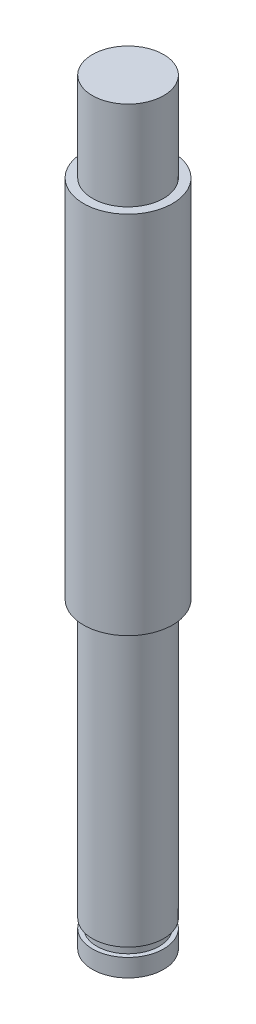
ISO-10303-21;
HEADER;
FILE_DESCRIPTION(('STEP AP214'),'2;1');
FILE_NAME('part.step','',(''),(''),'','','');
FILE_SCHEMA(('AUTOMOTIVE_DESIGN { 1 0 10303 214 1 1 1 1 }'));
ENDSEC;
DATA;
#1=APPLICATION_CONTEXT('core data for automotive mechanical design processes');
#2=APPLICATION_PROTOCOL_DEFINITION('international standard','automotive_design',2000,#1);
#3=PRODUCT_CONTEXT('',#1,'mechanical');
#4=PRODUCT('Part','Part','',(#3));
#5=PRODUCT_RELATED_PRODUCT_CATEGORY('part','',(#4));
#6=PRODUCT_DEFINITION_FORMATION('','',#4);
#7=PRODUCT_DEFINITION_CONTEXT('part definition',#1,'design');
#8=PRODUCT_DEFINITION('design','',#6,#7);
#9=PRODUCT_DEFINITION_SHAPE('','',#8);
#10=(LENGTH_UNIT() NAMED_UNIT(*) SI_UNIT(.MILLI.,.METRE.));
#11=(NAMED_UNIT(*) PLANE_ANGLE_UNIT() SI_UNIT($,.RADIAN.));
#12=(NAMED_UNIT(*) SI_UNIT($,.STERADIAN.) SOLID_ANGLE_UNIT());
#13=UNCERTAINTY_MEASURE_WITH_UNIT(LENGTH_MEASURE(1.E-05),#10,'distance_accuracy_value','');
#14=(GEOMETRIC_REPRESENTATION_CONTEXT(3) GLOBAL_UNCERTAINTY_ASSIGNED_CONTEXT((#13)) GLOBAL_UNIT_ASSIGNED_CONTEXT((#10,
#11,#12)) REPRESENTATION_CONTEXT('',''));
#15=CARTESIAN_POINT('',(0.,0.,0.));
#16=DIRECTION('',(0.,0.,1.));
#17=DIRECTION('',(1.,0.,0.));
#18=AXIS2_PLACEMENT_3D('',#15,#16,#17);
#19=CARTESIAN_POINT('',(0.,-34.,0.));
#20=DIRECTION('',(0.,-1.,0.));
#21=DIRECTION('',(0.,0.,-1.));
#22=AXIS2_PLACEMENT_3D('',#19,#20,#21);
#23=PLANE('',#22);
#24=CARTESIAN_POINT('',(0.,-34.,0.));
#25=DIRECTION('',(0.,-1.,0.));
#26=DIRECTION('',(0.,0.,-1.));
#27=AXIS2_PLACEMENT_3D('',#24,#25,#26);
#28=CIRCLE('',#27,4.);
#29=CARTESIAN_POINT('',(0.,-34.,-4.));
#30=VERTEX_POINT('',#29);
#31=EDGE_CURVE('E18',#30,#30,#28,.F.);
#32=ORIENTED_EDGE('',*,*,#31,.F.);
#33=EDGE_LOOP('',(#32));
#34=FACE_BOUND('',#33,.T.);
#35=ADVANCED_FACE('F15',(#34),#23,.T.);
#36=CARTESIAN_POINT('',(0.,0.,0.));
#37=DIRECTION('',(0.,-1.,0.));
#38=DIRECTION('',(0.,0.,-1.));
#39=AXIS2_PLACEMENT_3D('',#36,#37,#38);
#40=CYLINDRICAL_SURFACE('',#39,4.);
#41=ORIENTED_EDGE('',*,*,#31,.T.);
#42=EDGE_LOOP('',(#41));
#43=FACE_BOUND('',#42,.T.);
#44=CARTESIAN_POINT('',(0.,-32.,0.));
#45=DIRECTION('',(0.,-1.,0.));
#46=DIRECTION('',(0.,0.,-1.));
#47=AXIS2_PLACEMENT_3D('',#44,#45,#46);
#48=CIRCLE('',#47,4.);
#49=CARTESIAN_POINT('',(0.,-32.,-4.));
#50=VERTEX_POINT('',#49);
#51=EDGE_CURVE('E46',#50,#50,#48,.T.);
#52=ORIENTED_EDGE('',*,*,#51,.T.);
#53=EDGE_LOOP('',(#52));
#54=FACE_BOUND('',#53,.T.);
#55=ADVANCED_FACE('F53',(#43,#54),#40,.T.);
#56=CARTESIAN_POINT('',(0.,-32.,0.));
#57=DIRECTION('',(0.,-1.,0.));
#58=DIRECTION('',(0.,0.,-1.));
#59=AXIS2_PLACEMENT_3D('',#56,#57,#58);
#60=PLANE('',#59);
#61=CARTESIAN_POINT('',(0.,-32.,0.));
#62=DIRECTION('',(0.,-1.,0.));
#63=DIRECTION('',(0.,0.,-1.));
#64=AXIS2_PLACEMENT_3D('',#61,#62,#63);
#65=CIRCLE('',#64,3.5);
#66=CARTESIAN_POINT('',(0.,-32.,-3.5));
#67=VERTEX_POINT('',#66);
#68=EDGE_CURVE('E44',#67,#67,#65,.F.);
#69=ORIENTED_EDGE('',*,*,#68,.F.);
#70=EDGE_LOOP('',(#69));
#71=FACE_BOUND('',#70,.T.);
#72=ORIENTED_EDGE('',*,*,#51,.F.);
#73=EDGE_LOOP('',(#72));
#74=FACE_BOUND('',#73,.T.);
#75=ADVANCED_FACE('F60',(#71,#74),#60,.F.);
#76=CARTESIAN_POINT('',(0.,0.,0.));
#77=DIRECTION('',(0.,-1.,0.));
#78=DIRECTION('',(0.,0.,-1.));
#79=AXIS2_PLACEMENT_3D('',#76,#77,#78);
#80=CYLINDRICAL_SURFACE('',#79,3.5);
#81=CARTESIAN_POINT('',(0.,-31.,0.));
#82=DIRECTION('',(0.,-1.,0.));
#83=DIRECTION('',(0.,0.,-1.));
#84=AXIS2_PLACEMENT_3D('',#81,#82,#83);
#85=CIRCLE('',#84,3.5);
#86=CARTESIAN_POINT('',(0.,-31.,-3.5));
#87=VERTEX_POINT('',#86);
#88=EDGE_CURVE('E41',#87,#87,#85,.F.);
#89=ORIENTED_EDGE('',*,*,#88,.F.);
#90=EDGE_LOOP('',(#89));
#91=FACE_BOUND('',#90,.T.);
#92=ORIENTED_EDGE('',*,*,#68,.T.);
#93=EDGE_LOOP('',(#92));
#94=FACE_BOUND('',#93,.T.);
#95=ADVANCED_FACE('F91',(#91,#94),#80,.T.);
#96=CARTESIAN_POINT('',(0.,51.,0.));
#97=DIRECTION('',(0.,-1.,0.));
#98=DIRECTION('',(0.,0.,-1.));
#99=AXIS2_PLACEMENT_3D('',#96,#97,#98);
#100=PLANE('',#99);
#101=CARTESIAN_POINT('',(0.,51.,0.));
#102=DIRECTION('',(0.,-1.,0.));
#103=DIRECTION('',(0.,0.,-1.));
#104=AXIS2_PLACEMENT_3D('',#101,#102,#103);
#105=CIRCLE('',#104,4.);
#106=CARTESIAN_POINT('',(0.,51.,-4.));
#107=VERTEX_POINT('',#106);
#108=EDGE_CURVE('E38',#107,#107,#105,.T.);
#109=ORIENTED_EDGE('',*,*,#108,.F.);
#110=EDGE_LOOP('',(#109));
#111=FACE_BOUND('',#110,.T.);
#112=ADVANCED_FACE('F87',(#111),#100,.F.);
#113=CARTESIAN_POINT('',(0.,-31.,0.));
#114=DIRECTION('',(0.,-1.,0.));
#115=DIRECTION('',(0.,0.,-1.));
#116=AXIS2_PLACEMENT_3D('',#113,#114,#115);
#117=PLANE('',#116);
#118=ORIENTED_EDGE('',*,*,#88,.T.);
#119=EDGE_LOOP('',(#118));
#120=FACE_BOUND('',#119,.T.);
#121=CARTESIAN_POINT('',(0.,-31.,0.));
#122=DIRECTION('',(0.,-1.,0.));
#123=DIRECTION('',(0.,0.,-1.));
#124=AXIS2_PLACEMENT_3D('',#121,#122,#123);
#125=CIRCLE('',#124,4.);
#126=CARTESIAN_POINT('',(0.,-31.,-4.));
#127=VERTEX_POINT('',#126);
#128=EDGE_CURVE('E35',#127,#127,#125,.F.);
#129=ORIENTED_EDGE('',*,*,#128,.F.);
#130=EDGE_LOOP('',(#129));
#131=FACE_BOUND('',#130,.T.);
#132=ADVANCED_FACE('F83',(#120,#131),#117,.T.);
#133=CARTESIAN_POINT('',(0.,0.,0.));
#134=DIRECTION('',(0.,-1.,0.));
#135=DIRECTION('',(0.,0.,-1.));
#136=AXIS2_PLACEMENT_3D('',#133,#134,#135);
#137=CYLINDRICAL_SURFACE('',#136,4.);
#138=ORIENTED_EDGE('',*,*,#108,.T.);
#139=EDGE_LOOP('',(#138));
#140=FACE_BOUND('',#139,.T.);
#141=CARTESIAN_POINT('',(0.,41.,0.));
#142=DIRECTION('',(0.,-1.,0.));
#143=DIRECTION('',(0.,0.,-1.));
#144=AXIS2_PLACEMENT_3D('',#141,#142,#143);
#145=CIRCLE('',#144,4.);
#146=CARTESIAN_POINT('',(0.,41.,-4.));
#147=VERTEX_POINT('',#146);
#148=EDGE_CURVE('E32',#147,#147,#145,.F.);
#149=ORIENTED_EDGE('',*,*,#148,.T.);
#150=EDGE_LOOP('',(#149));
#151=FACE_BOUND('',#150,.T.);
#152=ADVANCED_FACE('F79',(#140,#151),#137,.T.);
#153=CARTESIAN_POINT('',(0.,0.,0.));
#154=DIRECTION('',(0.,-1.,0.));
#155=DIRECTION('',(0.,0.,-1.));
#156=AXIS2_PLACEMENT_3D('',#153,#154,#155);
#157=CYLINDRICAL_SURFACE('',#156,4.);
#158=CARTESIAN_POINT('',(0.,0.,0.));
#159=DIRECTION('',(0.,-1.,0.));
#160=DIRECTION('',(0.,0.,-1.));
#161=AXIS2_PLACEMENT_3D('',#158,#159,#160);
#162=CIRCLE('',#161,4.);
#163=CARTESIAN_POINT('',(0.,0.,-4.));
#164=VERTEX_POINT('',#163);
#165=EDGE_CURVE('E27',#164,#164,#162,.F.);
#166=ORIENTED_EDGE('',*,*,#165,.F.);
#167=EDGE_LOOP('',(#166));
#168=FACE_BOUND('',#167,.T.);
#169=ORIENTED_EDGE('',*,*,#128,.T.);
#170=EDGE_LOOP('',(#169));
#171=FACE_BOUND('',#170,.T.);
#172=ADVANCED_FACE('F75',(#168,#171),#157,.T.);
#173=CARTESIAN_POINT('',(0.,41.,0.));
#174=DIRECTION('',(0.,-1.,0.));
#175=DIRECTION('',(0.,0.,-1.));
#176=AXIS2_PLACEMENT_3D('',#173,#174,#175);
#177=PLANE('',#176);
#178=ORIENTED_EDGE('',*,*,#148,.F.);
#179=EDGE_LOOP('',(#178));
#180=FACE_BOUND('',#179,.T.);
#181=CARTESIAN_POINT('',(0.,41.,0.));
#182=DIRECTION('',(0.,-1.,0.));
#183=DIRECTION('',(0.,0.,-1.));
#184=AXIS2_PLACEMENT_3D('',#181,#182,#183);
#185=CIRCLE('',#184,5.);
#186=CARTESIAN_POINT('',(0.,41.,-5.));
#187=VERTEX_POINT('',#186);
#188=EDGE_CURVE('E22',#187,#187,#185,.T.);
#189=ORIENTED_EDGE('',*,*,#188,.F.);
#190=EDGE_LOOP('',(#189));
#191=FACE_BOUND('',#190,.T.);
#192=ADVANCED_FACE('F68',(#180,#191),#177,.F.);
#193=CARTESIAN_POINT('',(0.,0.,0.));
#194=DIRECTION('',(0.,-1.,0.));
#195=DIRECTION('',(0.,0.,-1.));
#196=AXIS2_PLACEMENT_3D('',#193,#194,#195);
#197=PLANE('',#196);
#198=ORIENTED_EDGE('',*,*,#165,.T.);
#199=EDGE_LOOP('',(#198));
#200=FACE_BOUND('',#199,.T.);
#201=CARTESIAN_POINT('',(0.,0.,0.));
#202=DIRECTION('',(0.,-1.,0.));
#203=DIRECTION('',(0.,0.,-1.));
#204=AXIS2_PLACEMENT_3D('',#201,#202,#203);
#205=CIRCLE('',#204,5.);
#206=CARTESIAN_POINT('',(0.,0.,-5.));
#207=VERTEX_POINT('',#206);
#208=EDGE_CURVE('E10',#207,#207,#205,.F.);
#209=ORIENTED_EDGE('',*,*,#208,.F.);
#210=EDGE_LOOP('',(#209));
#211=FACE_BOUND('',#210,.T.);
#212=ADVANCED_FACE('F63',(#200,#211),#197,.T.);
#213=CARTESIAN_POINT('',(0.,0.,0.));
#214=DIRECTION('',(0.,-1.,0.));
#215=DIRECTION('',(0.,0.,-1.));
#216=AXIS2_PLACEMENT_3D('',#213,#214,#215);
#217=CYLINDRICAL_SURFACE('',#216,5.);
#218=ORIENTED_EDGE('',*,*,#208,.T.);
#219=EDGE_LOOP('',(#218));
#220=FACE_BOUND('',#219,.T.);
#221=ORIENTED_EDGE('',*,*,#188,.T.);
#222=EDGE_LOOP('',(#221));
#223=FACE_BOUND('',#222,.T.);
#224=ADVANCED_FACE('F61',(#220,#223),#217,.T.);
#225=CLOSED_SHELL('',(#35,#55,#75,#95,#112,#132,#152,#172,#192,#212,#224));
#226=MANIFOLD_SOLID_BREP('B1',#225);
#227=ADVANCED_BREP_SHAPE_REPRESENTATION('',(#18,#226),#14);
#228=SHAPE_DEFINITION_REPRESENTATION(#9,#227);
ENDSEC;
END-ISO-10303-21;
